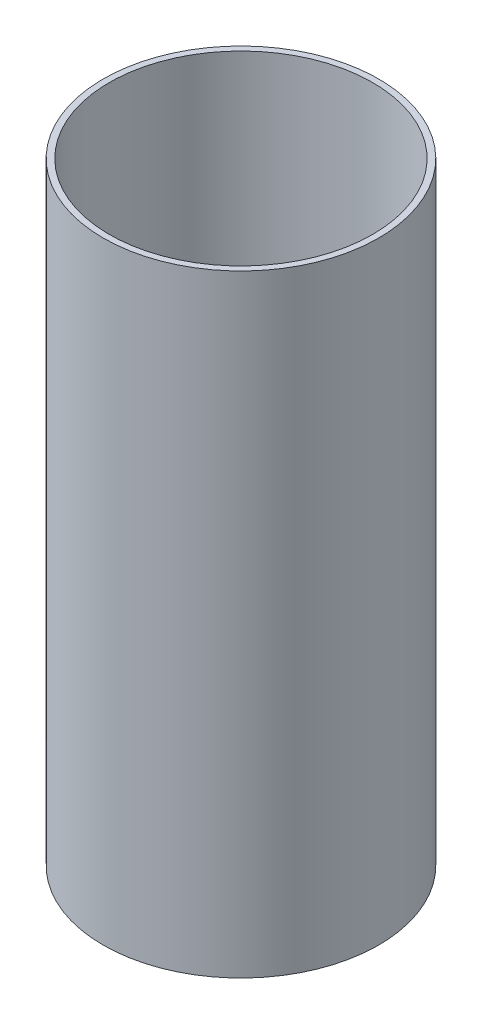
ISO-10303-21;
HEADER;
FILE_DESCRIPTION(('STEP AP214'),'2;1');
FILE_NAME('part.step','',(''),(''),'','','');
FILE_SCHEMA(('AUTOMOTIVE_DESIGN { 1 0 10303 214 1 1 1 1 }'));
ENDSEC;
DATA;
#1=APPLICATION_CONTEXT('core data for automotive mechanical design processes');
#2=APPLICATION_PROTOCOL_DEFINITION('international standard','automotive_design',2000,#1);
#3=PRODUCT_CONTEXT('',#1,'mechanical');
#4=PRODUCT('Part','Part','',(#3));
#5=PRODUCT_RELATED_PRODUCT_CATEGORY('part','',(#4));
#6=PRODUCT_DEFINITION_FORMATION('','',#4);
#7=PRODUCT_DEFINITION_CONTEXT('part definition',#1,'design');
#8=PRODUCT_DEFINITION('design','',#6,#7);
#9=PRODUCT_DEFINITION_SHAPE('','',#8);
#10=(LENGTH_UNIT() NAMED_UNIT(*) SI_UNIT(.MILLI.,.METRE.));
#11=(NAMED_UNIT(*) PLANE_ANGLE_UNIT() SI_UNIT($,.RADIAN.));
#12=(NAMED_UNIT(*) SI_UNIT($,.STERADIAN.) SOLID_ANGLE_UNIT());
#13=UNCERTAINTY_MEASURE_WITH_UNIT(LENGTH_MEASURE(1.E-05),#10,'distance_accuracy_value','');
#14=(GEOMETRIC_REPRESENTATION_CONTEXT(3) GLOBAL_UNCERTAINTY_ASSIGNED_CONTEXT((#13)) GLOBAL_UNIT_ASSIGNED_CONTEXT((#10,
#11,#12)) REPRESENTATION_CONTEXT('',''));
#15=CARTESIAN_POINT('',(0.,0.,0.));
#16=DIRECTION('',(0.,0.,1.));
#17=DIRECTION('',(1.,0.,0.));
#18=AXIS2_PLACEMENT_3D('',#15,#16,#17);
#19=CARTESIAN_POINT('',(0.,200.,0.));
#20=DIRECTION('',(0.,1.,0.));
#21=DIRECTION('',(0.,0.,1.));
#22=AXIS2_PLACEMENT_3D('',#19,#20,#21);
#23=PLANE('',#22);
#24=CARTESIAN_POINT('',(0.,200.,0.));
#25=DIRECTION('',(0.,1.,0.));
#26=DIRECTION('',(0.,0.,1.));
#27=AXIS2_PLACEMENT_3D('',#24,#25,#26);
#28=CIRCLE('',#27,45.);
#29=CARTESIAN_POINT('',(0.,200.,45.));
#30=VERTEX_POINT('',#29);
#31=EDGE_CURVE('E11',#30,#30,#28,.T.);
#32=ORIENTED_EDGE('',*,*,#31,.T.);
#33=EDGE_LOOP('',(#32));
#34=FACE_BOUND('',#33,.T.);
#35=CARTESIAN_POINT('',(0.,200.,0.));
#36=DIRECTION('',(0.,1.,0.));
#37=DIRECTION('',(1.,0.,0.));
#38=AXIS2_PLACEMENT_3D('',#35,#36,#37);
#39=CIRCLE('',#38,43.);
#40=CARTESIAN_POINT('',(43.,200.,0.));
#41=VERTEX_POINT('',#40);
#42=EDGE_CURVE('E48',#41,#41,#39,.T.);
#43=ORIENTED_EDGE('',*,*,#42,.F.);
#44=EDGE_LOOP('',(#43));
#45=FACE_BOUND('',#44,.T.);
#46=ADVANCED_FACE('F37',(#34,#45),#23,.T.);
#47=CARTESIAN_POINT('',(0.,0.,0.));
#48=DIRECTION('',(0.,1.,0.));
#49=DIRECTION('',(0.,0.,1.));
#50=AXIS2_PLACEMENT_3D('',#47,#48,#49);
#51=PLANE('',#50);
#52=CARTESIAN_POINT('',(0.,0.,0.));
#53=DIRECTION('',(0.,1.,0.));
#54=DIRECTION('',(0.,0.,1.));
#55=AXIS2_PLACEMENT_3D('',#52,#53,#54);
#56=CIRCLE('',#55,45.);
#57=CARTESIAN_POINT('',(0.,0.,45.));
#58=VERTEX_POINT('',#57);
#59=EDGE_CURVE('E41',#58,#58,#56,.T.);
#60=ORIENTED_EDGE('',*,*,#59,.F.);
#61=EDGE_LOOP('',(#60));
#62=FACE_BOUND('',#61,.T.);
#63=CARTESIAN_POINT('',(0.,0.,0.));
#64=DIRECTION('',(0.,1.,0.));
#65=DIRECTION('',(1.,0.,0.));
#66=AXIS2_PLACEMENT_3D('',#63,#64,#65);
#67=CIRCLE('',#66,43.);
#68=CARTESIAN_POINT('',(43.,0.,0.));
#69=VERTEX_POINT('',#68);
#70=EDGE_CURVE('E50',#69,#69,#67,.T.);
#71=ORIENTED_EDGE('',*,*,#70,.T.);
#72=EDGE_LOOP('',(#71));
#73=FACE_BOUND('',#72,.T.);
#74=ADVANCED_FACE('F60',(#62,#73),#51,.F.);
#75=CARTESIAN_POINT('',(0.,200.,0.));
#76=DIRECTION('',(0.,-1.,0.));
#77=DIRECTION('',(0.,0.,-1.));
#78=AXIS2_PLACEMENT_3D('',#75,#76,#77);
#79=CYLINDRICAL_SURFACE('',#78,45.);
#80=ORIENTED_EDGE('',*,*,#31,.F.);
#81=EDGE_LOOP('',(#80));
#82=FACE_BOUND('',#81,.T.);
#83=ORIENTED_EDGE('',*,*,#59,.T.);
#84=EDGE_LOOP('',(#83));
#85=FACE_BOUND('',#84,.T.);
#86=ADVANCED_FACE('F39',(#82,#85),#79,.T.);
#87=CARTESIAN_POINT('',(0.,200.,0.));
#88=DIRECTION('',(0.,-1.,0.));
#89=DIRECTION('',(0.,0.,-1.));
#90=AXIS2_PLACEMENT_3D('',#87,#88,#89);
#91=CYLINDRICAL_SURFACE('',#90,43.);
#92=ORIENTED_EDGE('',*,*,#42,.T.);
#93=EDGE_LOOP('',(#92));
#94=FACE_BOUND('',#93,.T.);
#95=ORIENTED_EDGE('',*,*,#70,.F.);
#96=EDGE_LOOP('',(#95));
#97=FACE_BOUND('',#96,.T.);
#98=ADVANCED_FACE('F56',(#94,#97),#91,.F.);
#99=CLOSED_SHELL('',(#46,#74,#86,#98));
#100=MANIFOLD_SOLID_BREP('B2',#99);
#101=ADVANCED_BREP_SHAPE_REPRESENTATION('',(#18,#100),#14);
#102=SHAPE_DEFINITION_REPRESENTATION(#9,#101);
ENDSEC;
END-ISO-10303-21;
